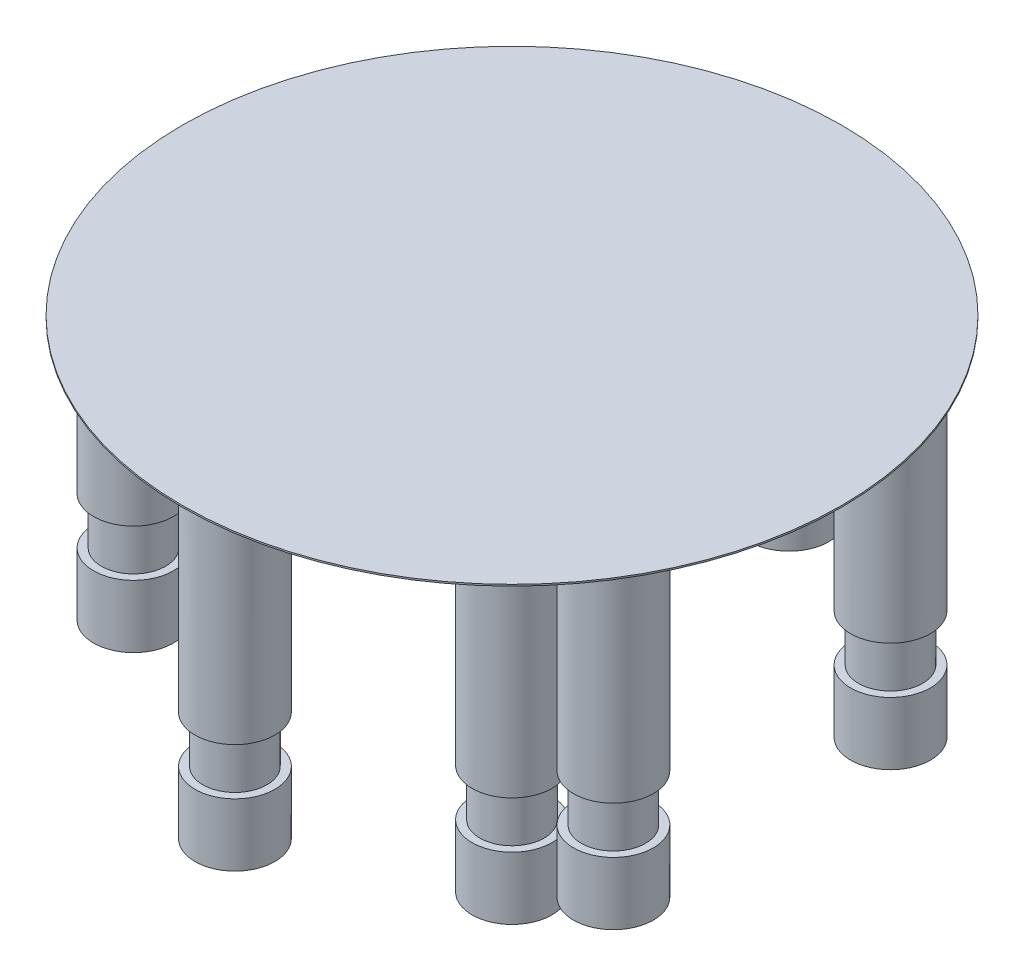
ISO-10303-21;
HEADER;
FILE_DESCRIPTION(('STEP AP214'),'2;1');
FILE_NAME('part.step','',(''),(''),'','','');
FILE_SCHEMA(('AUTOMOTIVE_DESIGN { 1 0 10303 214 1 1 1 1 }'));
ENDSEC;
DATA;
#1=APPLICATION_CONTEXT('core data for automotive mechanical design processes');
#2=APPLICATION_PROTOCOL_DEFINITION('international standard','automotive_design',2000,#1);
#3=PRODUCT_CONTEXT('',#1,'mechanical');
#4=PRODUCT('Part','Part','',(#3));
#5=PRODUCT_RELATED_PRODUCT_CATEGORY('part','',(#4));
#6=PRODUCT_DEFINITION_FORMATION('','',#4);
#7=PRODUCT_DEFINITION_CONTEXT('part definition',#1,'design');
#8=PRODUCT_DEFINITION('design','',#6,#7);
#9=PRODUCT_DEFINITION_SHAPE('','',#8);
#10=(LENGTH_UNIT() NAMED_UNIT(*) SI_UNIT(.MILLI.,.METRE.));
#11=(NAMED_UNIT(*) PLANE_ANGLE_UNIT() SI_UNIT($,.RADIAN.));
#12=(NAMED_UNIT(*) SI_UNIT($,.STERADIAN.) SOLID_ANGLE_UNIT());
#13=UNCERTAINTY_MEASURE_WITH_UNIT(LENGTH_MEASURE(1.E-05),#10,'distance_accuracy_value','');
#14=(GEOMETRIC_REPRESENTATION_CONTEXT(3) GLOBAL_UNCERTAINTY_ASSIGNED_CONTEXT((#13)) GLOBAL_UNIT_ASSIGNED_CONTEXT((#10,
#11,#12)) REPRESENTATION_CONTEXT('',''));
#15=CARTESIAN_POINT('',(0.,0.,0.));
#16=DIRECTION('',(0.,0.,1.));
#17=DIRECTION('',(1.,0.,0.));
#18=AXIS2_PLACEMENT_3D('',#15,#16,#17);
#19=CARTESIAN_POINT('',(0.,0.0254,0.));
#20=DIRECTION('',(0.,-1.,0.));
#21=DIRECTION('',(0.,0.,-1.));
#22=AXIS2_PLACEMENT_3D('',#19,#20,#21);
#23=CYLINDRICAL_SURFACE('',#22,5.3467);
#24=CARTESIAN_POINT('',(0.,0.0254,0.));
#25=DIRECTION('',(0.,1.,0.));
#26=DIRECTION('',(1.,0.,0.));
#27=AXIS2_PLACEMENT_3D('',#24,#25,#26);
#28=CIRCLE('',#27,5.3467);
#29=CARTESIAN_POINT('',(5.3467,0.0254,0.));
#30=VERTEX_POINT('',#29);
#31=EDGE_CURVE('E42',#30,#30,#28,.T.);
#32=ORIENTED_EDGE('',*,*,#31,.F.);
#33=EDGE_LOOP('',(#32));
#34=FACE_BOUND('',#33,.T.);
#35=CARTESIAN_POINT('',(0.,0.,0.));
#36=DIRECTION('',(0.,1.,0.));
#37=DIRECTION('',(1.,0.,0.));
#38=AXIS2_PLACEMENT_3D('',#35,#36,#37);
#39=CIRCLE('',#38,5.3467);
#40=CARTESIAN_POINT('',(5.3467,0.,0.));
#41=VERTEX_POINT('',#40);
#42=EDGE_CURVE('E43',#41,#41,#39,.T.);
#43=ORIENTED_EDGE('',*,*,#42,.T.);
#44=EDGE_LOOP('',(#43));
#45=FACE_BOUND('',#44,.T.);
#46=ADVANCED_FACE('F14',(#34,#45),#23,.T.);
#47=CARTESIAN_POINT('',(0.,0.0254,0.));
#48=DIRECTION('',(0.,1.,0.));
#49=DIRECTION('',(0.,0.,1.));
#50=AXIS2_PLACEMENT_3D('',#47,#48,#49);
#51=PLANE('',#50);
#52=ORIENTED_EDGE('',*,*,#31,.T.);
#53=EDGE_LOOP('',(#52));
#54=FACE_BOUND('',#53,.T.);
#55=ADVANCED_FACE('F192',(#54),#51,.T.);
#56=CARTESIAN_POINT('',(0.,0.,0.));
#57=DIRECTION('',(0.,1.,0.));
#58=DIRECTION('',(0.,0.,1.));
#59=AXIS2_PLACEMENT_3D('',#56,#57,#58);
#60=PLANE('',#59);
#61=CARTESIAN_POINT('',(0.,0.,0.));
#62=DIRECTION('',(0.,1.,0.));
#63=DIRECTION('',(0.,0.,1.));
#64=AXIS2_PLACEMENT_3D('',#61,#62,#63);
#65=CIRCLE('',#64,0.6477);
#66=CARTESIAN_POINT('',(0.,0.,0.6477));
#67=VERTEX_POINT('',#66);
#68=EDGE_CURVE('E10',#67,#67,#65,.F.);
#69=ORIENTED_EDGE('',*,*,#68,.F.);
#70=EDGE_LOOP('',(#69));
#71=FACE_BOUND('',#70,.T.);
#72=CARTESIAN_POINT('',(-3.89347701033408,0.,2.2479));
#73=DIRECTION('',(0.,1.,0.));
#74=DIRECTION('',(0.,0.,1.));
#75=AXIS2_PLACEMENT_3D('',#72,#73,#74);
#76=CIRCLE('',#75,0.6477);
#77=CARTESIAN_POINT('',(-3.89347701033408,0.,2.8956));
#78=VERTEX_POINT('',#77);
#79=EDGE_CURVE('E20',#78,#78,#76,.F.);
#80=ORIENTED_EDGE('',*,*,#79,.F.);
#81=EDGE_LOOP('',(#80));
#82=FACE_BOUND('',#81,.T.);
#83=CARTESIAN_POINT('',(-3.89347701033408,0.,-2.2479));
#84=DIRECTION('',(0.,1.,0.));
#85=DIRECTION('',(0.,0.,1.));
#86=AXIS2_PLACEMENT_3D('',#83,#84,#85);
#87=CIRCLE('',#86,0.6477);
#88=CARTESIAN_POINT('',(-3.89347701033408,0.,-1.6002));
#89=VERTEX_POINT('',#88);
#90=EDGE_CURVE('E24',#89,#89,#87,.F.);
#91=ORIENTED_EDGE('',*,*,#90,.F.);
#92=EDGE_LOOP('',(#91));
#93=FACE_BOUND('',#92,.T.);
#94=CARTESIAN_POINT('',(0.,0.,-4.4958));
#95=DIRECTION('',(0.,1.,0.));
#96=DIRECTION('',(0.,0.,1.));
#97=AXIS2_PLACEMENT_3D('',#94,#95,#96);
#98=CIRCLE('',#97,0.6477);
#99=CARTESIAN_POINT('',(0.,0.,-3.8481));
#100=VERTEX_POINT('',#99);
#101=EDGE_CURVE('E28',#100,#100,#98,.F.);
#102=ORIENTED_EDGE('',*,*,#101,.F.);
#103=EDGE_LOOP('',(#102));
#104=FACE_BOUND('',#103,.T.);
#105=CARTESIAN_POINT('',(3.89347701033408,0.,-2.2479));
#106=DIRECTION('',(0.,1.,0.));
#107=DIRECTION('',(0.,0.,1.));
#108=AXIS2_PLACEMENT_3D('',#105,#106,#107);
#109=CIRCLE('',#108,0.6477);
#110=CARTESIAN_POINT('',(3.89347701033408,0.,-1.6002));
#111=VERTEX_POINT('',#110);
#112=EDGE_CURVE('E33',#111,#111,#109,.F.);
#113=ORIENTED_EDGE('',*,*,#112,.F.);
#114=EDGE_LOOP('',(#113));
#115=FACE_BOUND('',#114,.T.);
#116=CARTESIAN_POINT('',(3.89347701033408,0.,2.2479));
#117=DIRECTION('',(0.,1.,0.));
#118=DIRECTION('',(0.,0.,1.));
#119=AXIS2_PLACEMENT_3D('',#116,#117,#118);
#120=CIRCLE('',#119,0.6477);
#121=CARTESIAN_POINT('',(3.89347701033408,0.,2.8956));
#122=VERTEX_POINT('',#121);
#123=EDGE_CURVE('E36',#122,#122,#120,.F.);
#124=ORIENTED_EDGE('',*,*,#123,.F.);
#125=EDGE_LOOP('',(#124));
#126=FACE_BOUND('',#125,.T.);
#127=CARTESIAN_POINT('',(0.,0.,4.4958));
#128=DIRECTION('',(0.,1.,0.));
#129=DIRECTION('',(0.,0.,1.));
#130=AXIS2_PLACEMENT_3D('',#127,#128,#129);
#131=CIRCLE('',#130,0.6477);
#132=CARTESIAN_POINT('',(0.,0.,5.1435));
#133=VERTEX_POINT('',#132);
#134=EDGE_CURVE('E39',#133,#133,#131,.F.);
#135=ORIENTED_EDGE('',*,*,#134,.F.);
#136=EDGE_LOOP('',(#135));
#137=FACE_BOUND('',#136,.T.);
#138=ORIENTED_EDGE('',*,*,#42,.F.);
#139=EDGE_LOOP('',(#138));
#140=FACE_BOUND('',#139,.T.);
#141=ADVANCED_FACE('F197',(#71,#82,#93,#104,#115,#126,#137,#140),#60,.F.);
#142=CARTESIAN_POINT('',(0.,-5.08,4.4958));
#143=DIRECTION('',(0.,-1.,0.));
#144=DIRECTION('',(0.,0.,-1.));
#145=AXIS2_PLACEMENT_3D('',#142,#143,#144);
#146=CYLINDRICAL_SURFACE('',#145,0.6477);
#147=CARTESIAN_POINT('',(0.,-3.302,4.4958));
#148=DIRECTION('',(0.,-1.,0.));
#149=DIRECTION('',(0.,0.,-1.));
#150=AXIS2_PLACEMENT_3D('',#147,#148,#149);
#151=CIRCLE('',#150,0.6477);
#152=CARTESIAN_POINT('',(0.,-3.302,3.8481));
#153=VERTEX_POINT('',#152);
#154=EDGE_CURVE('E46',#153,#153,#151,.T.);
#155=ORIENTED_EDGE('',*,*,#154,.F.);
#156=EDGE_LOOP('',(#155));
#157=FACE_BOUND('',#156,.T.);
#158=ORIENTED_EDGE('',*,*,#134,.T.);
#159=EDGE_LOOP('',(#158));
#160=FACE_BOUND('',#159,.T.);
#161=ADVANCED_FACE('F205',(#157,#160),#146,.T.);
#162=CARTESIAN_POINT('',(0.6477,-3.302,4.4958));
#163=DIRECTION('',(0.,1.,0.));
#164=DIRECTION('',(0.,0.,1.));
#165=AXIS2_PLACEMENT_3D('',#162,#163,#164);
#166=PLANE('',#165);
#167=CARTESIAN_POINT('',(0.,-3.302,4.4958));
#168=DIRECTION('',(0.,-1.,0.));
#169=DIRECTION('',(0.,0.,-1.));
#170=AXIS2_PLACEMENT_3D('',#167,#168,#169);
#171=CIRCLE('',#170,0.5207);
#172=CARTESIAN_POINT('',(0.,-3.302,3.9751));
#173=VERTEX_POINT('',#172);
#174=EDGE_CURVE('E51',#173,#173,#171,.T.);
#175=ORIENTED_EDGE('',*,*,#174,.F.);
#176=EDGE_LOOP('',(#175));
#177=FACE_BOUND('',#176,.T.);
#178=ORIENTED_EDGE('',*,*,#154,.T.);
#179=EDGE_LOOP('',(#178));
#180=FACE_BOUND('',#179,.T.);
#181=ADVANCED_FACE('F210',(#177,#180),#166,.F.);
#182=CARTESIAN_POINT('',(0.,-5.08,4.4958));
#183=DIRECTION('',(0.,-1.,0.));
#184=DIRECTION('',(0.,0.,-1.));
#185=AXIS2_PLACEMENT_3D('',#182,#183,#184);
#186=CYLINDRICAL_SURFACE('',#185,0.5207);
#187=CARTESIAN_POINT('',(0.,-4.064,4.4958));
#188=DIRECTION('',(0.,-1.,0.));
#189=DIRECTION('',(0.,0.,-1.));
#190=AXIS2_PLACEMENT_3D('',#187,#188,#189);
#191=CIRCLE('',#190,0.5207);
#192=CARTESIAN_POINT('',(0.,-4.064,3.9751));
#193=VERTEX_POINT('',#192);
#194=EDGE_CURVE('E54',#193,#193,#191,.T.);
#195=ORIENTED_EDGE('',*,*,#194,.F.);
#196=EDGE_LOOP('',(#195));
#197=FACE_BOUND('',#196,.T.);
#198=ORIENTED_EDGE('',*,*,#174,.T.);
#199=EDGE_LOOP('',(#198));
#200=FACE_BOUND('',#199,.T.);
#201=ADVANCED_FACE('F217',(#197,#200),#186,.T.);
#202=CARTESIAN_POINT('',(0.5207,-4.064,4.4958));
#203=DIRECTION('',(0.,-1.,0.));
#204=DIRECTION('',(0.,0.,-1.));
#205=AXIS2_PLACEMENT_3D('',#202,#203,#204);
#206=PLANE('',#205);
#207=CARTESIAN_POINT('',(0.,-4.064,4.4958));
#208=DIRECTION('',(0.,-1.,0.));
#209=DIRECTION('',(0.,0.,-1.));
#210=AXIS2_PLACEMENT_3D('',#207,#208,#209);
#211=CIRCLE('',#210,0.6477);
#212=CARTESIAN_POINT('',(0.,-4.064,3.8481));
#213=VERTEX_POINT('',#212);
#214=EDGE_CURVE('E57',#213,#213,#211,.T.);
#215=ORIENTED_EDGE('',*,*,#214,.F.);
#216=EDGE_LOOP('',(#215));
#217=FACE_BOUND('',#216,.T.);
#218=ORIENTED_EDGE('',*,*,#194,.T.);
#219=EDGE_LOOP('',(#218));
#220=FACE_BOUND('',#219,.T.);
#221=ADVANCED_FACE('F221',(#217,#220),#206,.F.);
#222=CARTESIAN_POINT('',(0.,-5.08,4.4958));
#223=DIRECTION('',(0.,-1.,0.));
#224=DIRECTION('',(0.,0.,-1.));
#225=AXIS2_PLACEMENT_3D('',#222,#223,#224);
#226=CYLINDRICAL_SURFACE('',#225,0.6477);
#227=CARTESIAN_POINT('',(0.,-5.08,4.4958));
#228=DIRECTION('',(0.,-1.,0.));
#229=DIRECTION('',(0.,0.,-1.));
#230=AXIS2_PLACEMENT_3D('',#227,#228,#229);
#231=CIRCLE('',#230,0.6477);
#232=CARTESIAN_POINT('',(0.,-5.08,3.8481));
#233=VERTEX_POINT('',#232);
#234=EDGE_CURVE('E60',#233,#233,#231,.T.);
#235=ORIENTED_EDGE('',*,*,#234,.F.);
#236=EDGE_LOOP('',(#235));
#237=FACE_BOUND('',#236,.T.);
#238=ORIENTED_EDGE('',*,*,#214,.T.);
#239=EDGE_LOOP('',(#238));
#240=FACE_BOUND('',#239,.T.);
#241=ADVANCED_FACE('F225',(#237,#240),#226,.T.);
#242=CARTESIAN_POINT('',(0.6477,-5.08,4.4958));
#243=DIRECTION('',(0.,1.,0.));
#244=DIRECTION('',(0.,0.,1.));
#245=AXIS2_PLACEMENT_3D('',#242,#243,#244);
#246=PLANE('',#245);
#247=ORIENTED_EDGE('',*,*,#234,.T.);
#248=EDGE_LOOP('',(#247));
#249=FACE_BOUND('',#248,.T.);
#250=ADVANCED_FACE('F229',(#249),#246,.F.);
#251=CARTESIAN_POINT('',(3.89347701033408,-5.08,2.2479));
#252=DIRECTION('',(0.,-1.,0.));
#253=DIRECTION('',(0.,0.,-1.));
#254=AXIS2_PLACEMENT_3D('',#251,#252,#253);
#255=CYLINDRICAL_SURFACE('',#254,0.6477);
#256=CARTESIAN_POINT('',(3.89347701033408,-3.302,2.2479));
#257=DIRECTION('',(0.,-1.,0.));
#258=DIRECTION('',(0.,0.,-1.));
#259=AXIS2_PLACEMENT_3D('',#256,#257,#258);
#260=CIRCLE('',#259,0.6477);
#261=CARTESIAN_POINT('',(3.89347701033408,-3.302,1.6002));
#262=VERTEX_POINT('',#261);
#263=EDGE_CURVE('E63',#262,#262,#260,.T.);
#264=ORIENTED_EDGE('',*,*,#263,.F.);
#265=EDGE_LOOP('',(#264));
#266=FACE_BOUND('',#265,.T.);
#267=ORIENTED_EDGE('',*,*,#123,.T.);
#268=EDGE_LOOP('',(#267));
#269=FACE_BOUND('',#268,.T.);
#270=ADVANCED_FACE('F233',(#266,#269),#255,.T.);
#271=CARTESIAN_POINT('',(4.21732701033408,-3.302,1.68697534596882));
#272=DIRECTION('',(0.,1.,0.));
#273=DIRECTION('',(0.,0.,1.));
#274=AXIS2_PLACEMENT_3D('',#271,#272,#273);
#275=PLANE('',#274);
#276=CARTESIAN_POINT('',(3.89347701033408,-3.302,2.2479));
#277=DIRECTION('',(0.,-1.,0.));
#278=DIRECTION('',(0.,0.,-1.));
#279=AXIS2_PLACEMENT_3D('',#276,#277,#278);
#280=CIRCLE('',#279,0.5207);
#281=CARTESIAN_POINT('',(3.89347701033408,-3.302,1.7272));
#282=VERTEX_POINT('',#281);
#283=EDGE_CURVE('E66',#282,#282,#280,.T.);
#284=ORIENTED_EDGE('',*,*,#283,.F.);
#285=EDGE_LOOP('',(#284));
#286=FACE_BOUND('',#285,.T.);
#287=ORIENTED_EDGE('',*,*,#263,.T.);
#288=EDGE_LOOP('',(#287));
#289=FACE_BOUND('',#288,.T.);
#290=ADVANCED_FACE('F237',(#286,#289),#275,.F.);
#291=CARTESIAN_POINT('',(3.89347701033408,-5.08,2.2479));
#292=DIRECTION('',(0.,-1.,0.));
#293=DIRECTION('',(0.,0.,-1.));
#294=AXIS2_PLACEMENT_3D('',#291,#292,#293);
#295=CYLINDRICAL_SURFACE('',#294,0.5207);
#296=CARTESIAN_POINT('',(3.89347701033408,-4.064,2.2479));
#297=DIRECTION('',(0.,-1.,0.));
#298=DIRECTION('',(0.,0.,-1.));
#299=AXIS2_PLACEMENT_3D('',#296,#297,#298);
#300=CIRCLE('',#299,0.5207);
#301=CARTESIAN_POINT('',(3.89347701033408,-4.064,1.7272));
#302=VERTEX_POINT('',#301);
#303=EDGE_CURVE('E69',#302,#302,#300,.T.);
#304=ORIENTED_EDGE('',*,*,#303,.F.);
#305=EDGE_LOOP('',(#304));
#306=FACE_BOUND('',#305,.T.);
#307=ORIENTED_EDGE('',*,*,#283,.T.);
#308=EDGE_LOOP('',(#307));
#309=FACE_BOUND('',#308,.T.);
#310=ADVANCED_FACE('F241',(#306,#309),#295,.T.);
#311=CARTESIAN_POINT('',(4.15382701033408,-4.064,1.79696057224944));
#312=DIRECTION('',(0.,-1.,0.));
#313=DIRECTION('',(0.,0.,-1.));
#314=AXIS2_PLACEMENT_3D('',#311,#312,#313);
#315=PLANE('',#314);
#316=CARTESIAN_POINT('',(3.89347701033408,-4.064,2.2479));
#317=DIRECTION('',(0.,-1.,0.));
#318=DIRECTION('',(0.,0.,-1.));
#319=AXIS2_PLACEMENT_3D('',#316,#317,#318);
#320=CIRCLE('',#319,0.6477);
#321=CARTESIAN_POINT('',(3.89347701033408,-4.064,1.6002));
#322=VERTEX_POINT('',#321);
#323=EDGE_CURVE('E72',#322,#322,#320,.T.);
#324=ORIENTED_EDGE('',*,*,#323,.F.);
#325=EDGE_LOOP('',(#324));
#326=FACE_BOUND('',#325,.T.);
#327=ORIENTED_EDGE('',*,*,#303,.T.);
#328=EDGE_LOOP('',(#327));
#329=FACE_BOUND('',#328,.T.);
#330=ADVANCED_FACE('F245',(#326,#329),#315,.F.);
#331=CARTESIAN_POINT('',(3.89347701033408,-5.08,2.2479));
#332=DIRECTION('',(0.,-1.,0.));
#333=DIRECTION('',(0.,0.,-1.));
#334=AXIS2_PLACEMENT_3D('',#331,#332,#333);
#335=CYLINDRICAL_SURFACE('',#334,0.6477);
#336=CARTESIAN_POINT('',(3.89347701033408,-5.08,2.2479));
#337=DIRECTION('',(0.,-1.,0.));
#338=DIRECTION('',(0.,0.,-1.));
#339=AXIS2_PLACEMENT_3D('',#336,#337,#338);
#340=CIRCLE('',#339,0.6477);
#341=CARTESIAN_POINT('',(3.89347701033408,-5.08,1.6002));
#342=VERTEX_POINT('',#341);
#343=EDGE_CURVE('E75',#342,#342,#340,.T.);
#344=ORIENTED_EDGE('',*,*,#343,.F.);
#345=EDGE_LOOP('',(#344));
#346=FACE_BOUND('',#345,.T.);
#347=ORIENTED_EDGE('',*,*,#323,.T.);
#348=EDGE_LOOP('',(#347));
#349=FACE_BOUND('',#348,.T.);
#350=ADVANCED_FACE('F249',(#346,#349),#335,.T.);
#351=CARTESIAN_POINT('',(4.21732701033408,-5.08,1.68697534596882));
#352=DIRECTION('',(0.,1.,0.));
#353=DIRECTION('',(0.,0.,1.));
#354=AXIS2_PLACEMENT_3D('',#351,#352,#353);
#355=PLANE('',#354);
#356=ORIENTED_EDGE('',*,*,#343,.T.);
#357=EDGE_LOOP('',(#356));
#358=FACE_BOUND('',#357,.T.);
#359=ADVANCED_FACE('F253',(#358),#355,.F.);
#360=CARTESIAN_POINT('',(3.89347701033408,-5.08,-2.2479));
#361=DIRECTION('',(0.,-1.,0.));
#362=DIRECTION('',(0.,0.,-1.));
#363=AXIS2_PLACEMENT_3D('',#360,#361,#362);
#364=CYLINDRICAL_SURFACE('',#363,0.6477);
#365=CARTESIAN_POINT('',(3.89347701033408,-3.302,-2.2479));
#366=DIRECTION('',(0.,-1.,0.));
#367=DIRECTION('',(0.,0.,-1.));
#368=AXIS2_PLACEMENT_3D('',#365,#366,#367);
#369=CIRCLE('',#368,0.6477);
#370=CARTESIAN_POINT('',(3.89347701033408,-3.302,-2.8956));
#371=VERTEX_POINT('',#370);
#372=EDGE_CURVE('E78',#371,#371,#369,.T.);
#373=ORIENTED_EDGE('',*,*,#372,.F.);
#374=EDGE_LOOP('',(#373));
#375=FACE_BOUND('',#374,.T.);
#376=ORIENTED_EDGE('',*,*,#112,.T.);
#377=EDGE_LOOP('',(#376));
#378=FACE_BOUND('',#377,.T.);
#379=ADVANCED_FACE('F257',(#375,#378),#364,.T.);
#380=CARTESIAN_POINT('',(3.56962701033408,-3.302,-2.80882465403118));
#381=DIRECTION('',(0.,1.,0.));
#382=DIRECTION('',(0.,0.,1.));
#383=AXIS2_PLACEMENT_3D('',#380,#381,#382);
#384=PLANE('',#383);
#385=CARTESIAN_POINT('',(3.89347701033408,-3.302,-2.2479));
#386=DIRECTION('',(0.,-1.,0.));
#387=DIRECTION('',(0.,0.,-1.));
#388=AXIS2_PLACEMENT_3D('',#385,#386,#387);
#389=CIRCLE('',#388,0.5207);
#390=CARTESIAN_POINT('',(3.89347701033408,-3.302,-2.7686));
#391=VERTEX_POINT('',#390);
#392=EDGE_CURVE('E81',#391,#391,#389,.T.);
#393=ORIENTED_EDGE('',*,*,#392,.F.);
#394=EDGE_LOOP('',(#393));
#395=FACE_BOUND('',#394,.T.);
#396=ORIENTED_EDGE('',*,*,#372,.T.);
#397=EDGE_LOOP('',(#396));
#398=FACE_BOUND('',#397,.T.);
#399=ADVANCED_FACE('F261',(#395,#398),#384,.F.);
#400=CARTESIAN_POINT('',(3.89347701033408,-5.08,-2.2479));
#401=DIRECTION('',(0.,-1.,0.));
#402=DIRECTION('',(0.,0.,-1.));
#403=AXIS2_PLACEMENT_3D('',#400,#401,#402);
#404=CYLINDRICAL_SURFACE('',#403,0.5207);
#405=CARTESIAN_POINT('',(3.89347701033408,-4.064,-2.2479));
#406=DIRECTION('',(0.,-1.,0.));
#407=DIRECTION('',(0.,0.,-1.));
#408=AXIS2_PLACEMENT_3D('',#405,#406,#407);
#409=CIRCLE('',#408,0.5207);
#410=CARTESIAN_POINT('',(3.89347701033408,-4.064,-2.7686));
#411=VERTEX_POINT('',#410);
#412=EDGE_CURVE('E84',#411,#411,#409,.T.);
#413=ORIENTED_EDGE('',*,*,#412,.F.);
#414=EDGE_LOOP('',(#413));
#415=FACE_BOUND('',#414,.T.);
#416=ORIENTED_EDGE('',*,*,#392,.T.);
#417=EDGE_LOOP('',(#416));
#418=FACE_BOUND('',#417,.T.);
#419=ADVANCED_FACE('F265',(#415,#418),#404,.T.);
#420=CARTESIAN_POINT('',(3.63312701033408,-4.064,-2.69883942775056));
#421=DIRECTION('',(0.,-1.,0.));
#422=DIRECTION('',(0.,0.,-1.));
#423=AXIS2_PLACEMENT_3D('',#420,#421,#422);
#424=PLANE('',#423);
#425=CARTESIAN_POINT('',(3.89347701033408,-4.064,-2.2479));
#426=DIRECTION('',(0.,-1.,0.));
#427=DIRECTION('',(0.,0.,-1.));
#428=AXIS2_PLACEMENT_3D('',#425,#426,#427);
#429=CIRCLE('',#428,0.6477);
#430=CARTESIAN_POINT('',(3.89347701033408,-4.064,-2.8956));
#431=VERTEX_POINT('',#430);
#432=EDGE_CURVE('E87',#431,#431,#429,.T.);
#433=ORIENTED_EDGE('',*,*,#432,.F.);
#434=EDGE_LOOP('',(#433));
#435=FACE_BOUND('',#434,.T.);
#436=ORIENTED_EDGE('',*,*,#412,.T.);
#437=EDGE_LOOP('',(#436));
#438=FACE_BOUND('',#437,.T.);
#439=ADVANCED_FACE('F269',(#435,#438),#424,.F.);
#440=CARTESIAN_POINT('',(3.89347701033408,-5.08,-2.2479));
#441=DIRECTION('',(0.,-1.,0.));
#442=DIRECTION('',(0.,0.,-1.));
#443=AXIS2_PLACEMENT_3D('',#440,#441,#442);
#444=CYLINDRICAL_SURFACE('',#443,0.6477);
#445=CARTESIAN_POINT('',(3.89347701033408,-5.08,-2.2479));
#446=DIRECTION('',(0.,-1.,0.));
#447=DIRECTION('',(0.,0.,-1.));
#448=AXIS2_PLACEMENT_3D('',#445,#446,#447);
#449=CIRCLE('',#448,0.6477);
#450=CARTESIAN_POINT('',(3.89347701033408,-5.08,-2.8956));
#451=VERTEX_POINT('',#450);
#452=EDGE_CURVE('E90',#451,#451,#449,.T.);
#453=ORIENTED_EDGE('',*,*,#452,.F.);
#454=EDGE_LOOP('',(#453));
#455=FACE_BOUND('',#454,.T.);
#456=ORIENTED_EDGE('',*,*,#432,.T.);
#457=EDGE_LOOP('',(#456));
#458=FACE_BOUND('',#457,.T.);
#459=ADVANCED_FACE('F273',(#455,#458),#444,.T.);
#460=CARTESIAN_POINT('',(3.56962701033408,-5.08,-2.80882465403118));
#461=DIRECTION('',(0.,1.,0.));
#462=DIRECTION('',(0.,0.,1.));
#463=AXIS2_PLACEMENT_3D('',#460,#461,#462);
#464=PLANE('',#463);
#465=ORIENTED_EDGE('',*,*,#452,.T.);
#466=EDGE_LOOP('',(#465));
#467=FACE_BOUND('',#466,.T.);
#468=ADVANCED_FACE('F277',(#467),#464,.F.);
#469=CARTESIAN_POINT('',(0.,-5.08,-4.4958));
#470=DIRECTION('',(0.,-1.,0.));
#471=DIRECTION('',(0.,0.,-1.));
#472=AXIS2_PLACEMENT_3D('',#469,#470,#471);
#473=CYLINDRICAL_SURFACE('',#472,0.6477);
#474=CARTESIAN_POINT('',(0.,-3.302,-4.4958));
#475=DIRECTION('',(0.,-1.,0.));
#476=DIRECTION('',(0.,0.,-1.));
#477=AXIS2_PLACEMENT_3D('',#474,#475,#476);
#478=CIRCLE('',#477,0.6477);
#479=CARTESIAN_POINT('',(0.,-3.302,-5.1435));
#480=VERTEX_POINT('',#479);
#481=EDGE_CURVE('E93',#480,#480,#478,.T.);
#482=ORIENTED_EDGE('',*,*,#481,.F.);
#483=EDGE_LOOP('',(#482));
#484=FACE_BOUND('',#483,.T.);
#485=ORIENTED_EDGE('',*,*,#101,.T.);
#486=EDGE_LOOP('',(#485));
#487=FACE_BOUND('',#486,.T.);
#488=ADVANCED_FACE('F281',(#484,#487),#473,.T.);
#489=CARTESIAN_POINT('',(-0.647699999999998,-3.302,-4.4958));
#490=DIRECTION('',(0.,1.,0.));
#491=DIRECTION('',(0.,0.,1.));
#492=AXIS2_PLACEMENT_3D('',#489,#490,#491);
#493=PLANE('',#492);
#494=CARTESIAN_POINT('',(0.,-3.302,-4.4958));
#495=DIRECTION('',(0.,-1.,0.));
#496=DIRECTION('',(0.,0.,-1.));
#497=AXIS2_PLACEMENT_3D('',#494,#495,#496);
#498=CIRCLE('',#497,0.5207);
#499=CARTESIAN_POINT('',(0.,-3.302,-5.0165));
#500=VERTEX_POINT('',#499);
#501=EDGE_CURVE('E96',#500,#500,#498,.T.);
#502=ORIENTED_EDGE('',*,*,#501,.F.);
#503=EDGE_LOOP('',(#502));
#504=FACE_BOUND('',#503,.T.);
#505=ORIENTED_EDGE('',*,*,#481,.T.);
#506=EDGE_LOOP('',(#505));
#507=FACE_BOUND('',#506,.T.);
#508=ADVANCED_FACE('F285',(#504,#507),#493,.F.);
#509=CARTESIAN_POINT('',(0.,-5.08,-4.4958));
#510=DIRECTION('',(0.,-1.,0.));
#511=DIRECTION('',(0.,0.,-1.));
#512=AXIS2_PLACEMENT_3D('',#509,#510,#511);
#513=CYLINDRICAL_SURFACE('',#512,0.5207);
#514=CARTESIAN_POINT('',(0.,-4.064,-4.4958));
#515=DIRECTION('',(0.,-1.,0.));
#516=DIRECTION('',(0.,0.,-1.));
#517=AXIS2_PLACEMENT_3D('',#514,#515,#516);
#518=CIRCLE('',#517,0.5207);
#519=CARTESIAN_POINT('',(0.,-4.064,-5.0165));
#520=VERTEX_POINT('',#519);
#521=EDGE_CURVE('E99',#520,#520,#518,.T.);
#522=ORIENTED_EDGE('',*,*,#521,.F.);
#523=EDGE_LOOP('',(#522));
#524=FACE_BOUND('',#523,.T.);
#525=ORIENTED_EDGE('',*,*,#501,.T.);
#526=EDGE_LOOP('',(#525));
#527=FACE_BOUND('',#526,.T.);
#528=ADVANCED_FACE('F289',(#524,#527),#513,.T.);
#529=CARTESIAN_POINT('',(-0.520699999999998,-4.064,-4.4958));
#530=DIRECTION('',(0.,-1.,0.));
#531=DIRECTION('',(0.,0.,-1.));
#532=AXIS2_PLACEMENT_3D('',#529,#530,#531);
#533=PLANE('',#532);
#534=CARTESIAN_POINT('',(0.,-4.064,-4.4958));
#535=DIRECTION('',(0.,-1.,0.));
#536=DIRECTION('',(0.,0.,-1.));
#537=AXIS2_PLACEMENT_3D('',#534,#535,#536);
#538=CIRCLE('',#537,0.6477);
#539=CARTESIAN_POINT('',(0.,-4.064,-5.1435));
#540=VERTEX_POINT('',#539);
#541=EDGE_CURVE('E102',#540,#540,#538,.T.);
#542=ORIENTED_EDGE('',*,*,#541,.F.);
#543=EDGE_LOOP('',(#542));
#544=FACE_BOUND('',#543,.T.);
#545=ORIENTED_EDGE('',*,*,#521,.T.);
#546=EDGE_LOOP('',(#545));
#547=FACE_BOUND('',#546,.T.);
#548=ADVANCED_FACE('F293',(#544,#547),#533,.F.);
#549=CARTESIAN_POINT('',(0.,-5.08,-4.4958));
#550=DIRECTION('',(0.,-1.,0.));
#551=DIRECTION('',(0.,0.,-1.));
#552=AXIS2_PLACEMENT_3D('',#549,#550,#551);
#553=CYLINDRICAL_SURFACE('',#552,0.6477);
#554=CARTESIAN_POINT('',(0.,-5.08,-4.4958));
#555=DIRECTION('',(0.,-1.,0.));
#556=DIRECTION('',(0.,0.,-1.));
#557=AXIS2_PLACEMENT_3D('',#554,#555,#556);
#558=CIRCLE('',#557,0.6477);
#559=CARTESIAN_POINT('',(0.,-5.08,-5.1435));
#560=VERTEX_POINT('',#559);
#561=EDGE_CURVE('E105',#560,#560,#558,.T.);
#562=ORIENTED_EDGE('',*,*,#561,.F.);
#563=EDGE_LOOP('',(#562));
#564=FACE_BOUND('',#563,.T.);
#565=ORIENTED_EDGE('',*,*,#541,.T.);
#566=EDGE_LOOP('',(#565));
#567=FACE_BOUND('',#566,.T.);
#568=ADVANCED_FACE('F297',(#564,#567),#553,.T.);
#569=CARTESIAN_POINT('',(-0.647699999999998,-5.08,-4.4958));
#570=DIRECTION('',(0.,1.,0.));
#571=DIRECTION('',(0.,0.,1.));
#572=AXIS2_PLACEMENT_3D('',#569,#570,#571);
#573=PLANE('',#572);
#574=ORIENTED_EDGE('',*,*,#561,.T.);
#575=EDGE_LOOP('',(#574));
#576=FACE_BOUND('',#575,.T.);
#577=ADVANCED_FACE('F301',(#576),#573,.F.);
#578=CARTESIAN_POINT('',(-3.89347701033408,-5.08,-2.2479));
#579=DIRECTION('',(0.,-1.,0.));
#580=DIRECTION('',(0.,0.,-1.));
#581=AXIS2_PLACEMENT_3D('',#578,#579,#580);
#582=CYLINDRICAL_SURFACE('',#581,0.6477);
#583=CARTESIAN_POINT('',(-3.89347701033408,-3.302,-2.2479));
#584=DIRECTION('',(0.,-1.,0.));
#585=DIRECTION('',(0.,0.,-1.));
#586=AXIS2_PLACEMENT_3D('',#583,#584,#585);
#587=CIRCLE('',#586,0.6477);
#588=CARTESIAN_POINT('',(-3.89347701033408,-3.302,-2.8956));
#589=VERTEX_POINT('',#588);
#590=EDGE_CURVE('E108',#589,#589,#587,.T.);
#591=ORIENTED_EDGE('',*,*,#590,.F.);
#592=EDGE_LOOP('',(#591));
#593=FACE_BOUND('',#592,.T.);
#594=ORIENTED_EDGE('',*,*,#90,.T.);
#595=EDGE_LOOP('',(#594));
#596=FACE_BOUND('',#595,.T.);
#597=ADVANCED_FACE('F305',(#593,#596),#582,.T.);
#598=CARTESIAN_POINT('',(-4.21732701033408,-3.302,-1.68697534596882));
#599=DIRECTION('',(0.,1.,0.));
#600=DIRECTION('',(0.,0.,1.));
#601=AXIS2_PLACEMENT_3D('',#598,#599,#600);
#602=PLANE('',#601);
#603=CARTESIAN_POINT('',(-3.89347701033408,-3.302,-2.2479));
#604=DIRECTION('',(0.,-1.,0.));
#605=DIRECTION('',(0.,0.,-1.));
#606=AXIS2_PLACEMENT_3D('',#603,#604,#605);
#607=CIRCLE('',#606,0.5207);
#608=CARTESIAN_POINT('',(-3.89347701033408,-3.302,-2.7686));
#609=VERTEX_POINT('',#608);
#610=EDGE_CURVE('E111',#609,#609,#607,.T.);
#611=ORIENTED_EDGE('',*,*,#610,.F.);
#612=EDGE_LOOP('',(#611));
#613=FACE_BOUND('',#612,.T.);
#614=ORIENTED_EDGE('',*,*,#590,.T.);
#615=EDGE_LOOP('',(#614));
#616=FACE_BOUND('',#615,.T.);
#617=ADVANCED_FACE('F309',(#613,#616),#602,.F.);
#618=CARTESIAN_POINT('',(-3.89347701033408,-5.08,-2.2479));
#619=DIRECTION('',(0.,-1.,0.));
#620=DIRECTION('',(0.,0.,-1.));
#621=AXIS2_PLACEMENT_3D('',#618,#619,#620);
#622=CYLINDRICAL_SURFACE('',#621,0.5207);
#623=CARTESIAN_POINT('',(-3.89347701033408,-4.064,-2.2479));
#624=DIRECTION('',(0.,-1.,0.));
#625=DIRECTION('',(0.,0.,-1.));
#626=AXIS2_PLACEMENT_3D('',#623,#624,#625);
#627=CIRCLE('',#626,0.5207);
#628=CARTESIAN_POINT('',(-3.89347701033408,-4.064,-2.7686));
#629=VERTEX_POINT('',#628);
#630=EDGE_CURVE('E114',#629,#629,#627,.T.);
#631=ORIENTED_EDGE('',*,*,#630,.F.);
#632=EDGE_LOOP('',(#631));
#633=FACE_BOUND('',#632,.T.);
#634=ORIENTED_EDGE('',*,*,#610,.T.);
#635=EDGE_LOOP('',(#634));
#636=FACE_BOUND('',#635,.T.);
#637=ADVANCED_FACE('F313',(#633,#636),#622,.T.);
#638=CARTESIAN_POINT('',(-4.15382701033408,-4.064,-1.79696057224944));
#639=DIRECTION('',(0.,-1.,0.));
#640=DIRECTION('',(0.,0.,-1.));
#641=AXIS2_PLACEMENT_3D('',#638,#639,#640);
#642=PLANE('',#641);
#643=CARTESIAN_POINT('',(-3.89347701033408,-4.064,-2.2479));
#644=DIRECTION('',(0.,-1.,0.));
#645=DIRECTION('',(0.,0.,-1.));
#646=AXIS2_PLACEMENT_3D('',#643,#644,#645);
#647=CIRCLE('',#646,0.6477);
#648=CARTESIAN_POINT('',(-3.89347701033408,-4.064,-2.8956));
#649=VERTEX_POINT('',#648);
#650=EDGE_CURVE('E117',#649,#649,#647,.T.);
#651=ORIENTED_EDGE('',*,*,#650,.F.);
#652=EDGE_LOOP('',(#651));
#653=FACE_BOUND('',#652,.T.);
#654=ORIENTED_EDGE('',*,*,#630,.T.);
#655=EDGE_LOOP('',(#654));
#656=FACE_BOUND('',#655,.T.);
#657=ADVANCED_FACE('F317',(#653,#656),#642,.F.);
#658=CARTESIAN_POINT('',(-3.89347701033408,-5.08,-2.2479));
#659=DIRECTION('',(0.,-1.,0.));
#660=DIRECTION('',(0.,0.,-1.));
#661=AXIS2_PLACEMENT_3D('',#658,#659,#660);
#662=CYLINDRICAL_SURFACE('',#661,0.6477);
#663=CARTESIAN_POINT('',(-3.89347701033408,-5.08,-2.2479));
#664=DIRECTION('',(0.,-1.,0.));
#665=DIRECTION('',(0.,0.,-1.));
#666=AXIS2_PLACEMENT_3D('',#663,#664,#665);
#667=CIRCLE('',#666,0.6477);
#668=CARTESIAN_POINT('',(-3.89347701033408,-5.08,-2.8956));
#669=VERTEX_POINT('',#668);
#670=EDGE_CURVE('E120',#669,#669,#667,.T.);
#671=ORIENTED_EDGE('',*,*,#670,.F.);
#672=EDGE_LOOP('',(#671));
#673=FACE_BOUND('',#672,.T.);
#674=ORIENTED_EDGE('',*,*,#650,.T.);
#675=EDGE_LOOP('',(#674));
#676=FACE_BOUND('',#675,.T.);
#677=ADVANCED_FACE('F321',(#673,#676),#662,.T.);
#678=CARTESIAN_POINT('',(-4.21732701033408,-5.08,-1.68697534596882));
#679=DIRECTION('',(0.,1.,0.));
#680=DIRECTION('',(0.,0.,1.));
#681=AXIS2_PLACEMENT_3D('',#678,#679,#680);
#682=PLANE('',#681);
#683=ORIENTED_EDGE('',*,*,#670,.T.);
#684=EDGE_LOOP('',(#683));
#685=FACE_BOUND('',#684,.T.);
#686=ADVANCED_FACE('F325',(#685),#682,.F.);
#687=CARTESIAN_POINT('',(-3.89347701033408,-5.08,2.2479));
#688=DIRECTION('',(0.,-1.,0.));
#689=DIRECTION('',(0.,0.,-1.));
#690=AXIS2_PLACEMENT_3D('',#687,#688,#689);
#691=CYLINDRICAL_SURFACE('',#690,0.6477);
#692=CARTESIAN_POINT('',(-3.89347701033408,-3.302,2.2479));
#693=DIRECTION('',(0.,-1.,0.));
#694=DIRECTION('',(0.,0.,-1.));
#695=AXIS2_PLACEMENT_3D('',#692,#693,#694);
#696=CIRCLE('',#695,0.6477);
#697=CARTESIAN_POINT('',(-3.89347701033408,-3.302,1.6002));
#698=VERTEX_POINT('',#697);
#699=EDGE_CURVE('E123',#698,#698,#696,.T.);
#700=ORIENTED_EDGE('',*,*,#699,.F.);
#701=EDGE_LOOP('',(#700));
#702=FACE_BOUND('',#701,.T.);
#703=ORIENTED_EDGE('',*,*,#79,.T.);
#704=EDGE_LOOP('',(#703));
#705=FACE_BOUND('',#704,.T.);
#706=ADVANCED_FACE('F329',(#702,#705),#691,.T.);
#707=CARTESIAN_POINT('',(-3.56962701033408,-3.302,2.80882465403118));
#708=DIRECTION('',(0.,1.,0.));
#709=DIRECTION('',(0.,0.,1.));
#710=AXIS2_PLACEMENT_3D('',#707,#708,#709);
#711=PLANE('',#710);
#712=CARTESIAN_POINT('',(-3.89347701033408,-3.302,2.2479));
#713=DIRECTION('',(0.,-1.,0.));
#714=DIRECTION('',(0.,0.,-1.));
#715=AXIS2_PLACEMENT_3D('',#712,#713,#714);
#716=CIRCLE('',#715,0.5207);
#717=CARTESIAN_POINT('',(-3.89347701033408,-3.302,1.7272));
#718=VERTEX_POINT('',#717);
#719=EDGE_CURVE('E126',#718,#718,#716,.T.);
#720=ORIENTED_EDGE('',*,*,#719,.F.);
#721=EDGE_LOOP('',(#720));
#722=FACE_BOUND('',#721,.T.);
#723=ORIENTED_EDGE('',*,*,#699,.T.);
#724=EDGE_LOOP('',(#723));
#725=FACE_BOUND('',#724,.T.);
#726=ADVANCED_FACE('F333',(#722,#725),#711,.F.);
#727=CARTESIAN_POINT('',(-3.89347701033408,-5.08,2.2479));
#728=DIRECTION('',(0.,-1.,0.));
#729=DIRECTION('',(0.,0.,-1.));
#730=AXIS2_PLACEMENT_3D('',#727,#728,#729);
#731=CYLINDRICAL_SURFACE('',#730,0.5207);
#732=CARTESIAN_POINT('',(-3.89347701033408,-4.064,2.2479));
#733=DIRECTION('',(0.,-1.,0.));
#734=DIRECTION('',(0.,0.,-1.));
#735=AXIS2_PLACEMENT_3D('',#732,#733,#734);
#736=CIRCLE('',#735,0.5207);
#737=CARTESIAN_POINT('',(-3.89347701033408,-4.064,1.7272));
#738=VERTEX_POINT('',#737);
#739=EDGE_CURVE('E129',#738,#738,#736,.T.);
#740=ORIENTED_EDGE('',*,*,#739,.F.);
#741=EDGE_LOOP('',(#740));
#742=FACE_BOUND('',#741,.T.);
#743=ORIENTED_EDGE('',*,*,#719,.T.);
#744=EDGE_LOOP('',(#743));
#745=FACE_BOUND('',#744,.T.);
#746=ADVANCED_FACE('F337',(#742,#745),#731,.T.);
#747=CARTESIAN_POINT('',(-3.63312701033408,-4.064,2.69883942775055));
#748=DIRECTION('',(0.,-1.,0.));
#749=DIRECTION('',(0.,0.,-1.));
#750=AXIS2_PLACEMENT_3D('',#747,#748,#749);
#751=PLANE('',#750);
#752=CARTESIAN_POINT('',(-3.89347701033408,-4.064,2.2479));
#753=DIRECTION('',(0.,-1.,0.));
#754=DIRECTION('',(0.,0.,-1.));
#755=AXIS2_PLACEMENT_3D('',#752,#753,#754);
#756=CIRCLE('',#755,0.6477);
#757=CARTESIAN_POINT('',(-3.89347701033408,-4.064,1.6002));
#758=VERTEX_POINT('',#757);
#759=EDGE_CURVE('E132',#758,#758,#756,.T.);
#760=ORIENTED_EDGE('',*,*,#759,.F.);
#761=EDGE_LOOP('',(#760));
#762=FACE_BOUND('',#761,.T.);
#763=ORIENTED_EDGE('',*,*,#739,.T.);
#764=EDGE_LOOP('',(#763));
#765=FACE_BOUND('',#764,.T.);
#766=ADVANCED_FACE('F341',(#762,#765),#751,.F.);
#767=CARTESIAN_POINT('',(-3.89347701033408,-5.08,2.2479));
#768=DIRECTION('',(0.,-1.,0.));
#769=DIRECTION('',(0.,0.,-1.));
#770=AXIS2_PLACEMENT_3D('',#767,#768,#769);
#771=CYLINDRICAL_SURFACE('',#770,0.6477);
#772=CARTESIAN_POINT('',(-3.89347701033408,-5.08,2.2479));
#773=DIRECTION('',(0.,-1.,0.));
#774=DIRECTION('',(0.,0.,-1.));
#775=AXIS2_PLACEMENT_3D('',#772,#773,#774);
#776=CIRCLE('',#775,0.6477);
#777=CARTESIAN_POINT('',(-3.89347701033408,-5.08,1.6002));
#778=VERTEX_POINT('',#777);
#779=EDGE_CURVE('E135',#778,#778,#776,.T.);
#780=ORIENTED_EDGE('',*,*,#779,.F.);
#781=EDGE_LOOP('',(#780));
#782=FACE_BOUND('',#781,.T.);
#783=ORIENTED_EDGE('',*,*,#759,.T.);
#784=EDGE_LOOP('',(#783));
#785=FACE_BOUND('',#784,.T.);
#786=ADVANCED_FACE('F188',(#782,#785),#771,.T.);
#787=CARTESIAN_POINT('',(-3.56962701033408,-5.08,2.80882465403118));
#788=DIRECTION('',(0.,1.,0.));
#789=DIRECTION('',(0.,0.,1.));
#790=AXIS2_PLACEMENT_3D('',#787,#788,#789);
#791=PLANE('',#790);
#792=ORIENTED_EDGE('',*,*,#779,.T.);
#793=EDGE_LOOP('',(#792));
#794=FACE_BOUND('',#793,.T.);
#795=ADVANCED_FACE('F182',(#794),#791,.F.);
#796=CARTESIAN_POINT('',(0.,-8.0772,0.));
#797=DIRECTION('',(0.,-1.,0.));
#798=DIRECTION('',(0.,0.,-1.));
#799=AXIS2_PLACEMENT_3D('',#796,#797,#798);
#800=CYLINDRICAL_SURFACE('',#799,0.6477);
#801=CARTESIAN_POINT('',(0.,-6.2992,0.));
#802=DIRECTION('',(0.,-1.,0.));
#803=DIRECTION('',(0.,0.,-1.));
#804=AXIS2_PLACEMENT_3D('',#801,#802,#803);
#805=CIRCLE('',#804,0.6477);
#806=CARTESIAN_POINT('',(0.,-6.2992,-0.6477));
#807=VERTEX_POINT('',#806);
#808=EDGE_CURVE('E138',#807,#807,#805,.T.);
#809=ORIENTED_EDGE('',*,*,#808,.F.);
#810=EDGE_LOOP('',(#809));
#811=FACE_BOUND('',#810,.T.);
#812=ORIENTED_EDGE('',*,*,#68,.T.);
#813=EDGE_LOOP('',(#812));
#814=FACE_BOUND('',#813,.T.);
#815=ADVANCED_FACE('F177',(#811,#814),#800,.T.);
#816=CARTESIAN_POINT('',(0.6477,-6.2992,0.));
#817=DIRECTION('',(0.,1.,0.));
#818=DIRECTION('',(0.,0.,1.));
#819=AXIS2_PLACEMENT_3D('',#816,#817,#818);
#820=PLANE('',#819);
#821=CARTESIAN_POINT('',(0.,-6.2992,0.));
#822=DIRECTION('',(0.,-1.,0.));
#823=DIRECTION('',(0.,0.,-1.));
#824=AXIS2_PLACEMENT_3D('',#821,#822,#823);
#825=CIRCLE('',#824,0.5207);
#826=CARTESIAN_POINT('',(0.,-6.2992,-0.5207));
#827=VERTEX_POINT('',#826);
#828=EDGE_CURVE('E141',#827,#827,#825,.T.);
#829=ORIENTED_EDGE('',*,*,#828,.F.);
#830=EDGE_LOOP('',(#829));
#831=FACE_BOUND('',#830,.T.);
#832=ORIENTED_EDGE('',*,*,#808,.T.);
#833=EDGE_LOOP('',(#832));
#834=FACE_BOUND('',#833,.T.);
#835=ADVANCED_FACE('F171',(#831,#834),#820,.F.);
#836=CARTESIAN_POINT('',(0.,-8.0772,0.));
#837=DIRECTION('',(0.,-1.,0.));
#838=DIRECTION('',(0.,0.,-1.));
#839=AXIS2_PLACEMENT_3D('',#836,#837,#838);
#840=CYLINDRICAL_SURFACE('',#839,0.5207);
#841=CARTESIAN_POINT('',(0.,-7.0612,0.));
#842=DIRECTION('',(0.,-1.,0.));
#843=DIRECTION('',(0.,0.,-1.));
#844=AXIS2_PLACEMENT_3D('',#841,#842,#843);
#845=CIRCLE('',#844,0.5207);
#846=CARTESIAN_POINT('',(0.,-7.0612,-0.5207));
#847=VERTEX_POINT('',#846);
#848=EDGE_CURVE('E144',#847,#847,#845,.T.);
#849=ORIENTED_EDGE('',*,*,#848,.F.);
#850=EDGE_LOOP('',(#849));
#851=FACE_BOUND('',#850,.T.);
#852=ORIENTED_EDGE('',*,*,#828,.T.);
#853=EDGE_LOOP('',(#852));
#854=FACE_BOUND('',#853,.T.);
#855=ADVANCED_FACE('F165',(#851,#854),#840,.T.);
#856=CARTESIAN_POINT('',(0.5207,-7.0612,0.));
#857=DIRECTION('',(0.,-1.,0.));
#858=DIRECTION('',(0.,0.,-1.));
#859=AXIS2_PLACEMENT_3D('',#856,#857,#858);
#860=PLANE('',#859);
#861=CARTESIAN_POINT('',(0.,-7.0612,0.));
#862=DIRECTION('',(0.,-1.,0.));
#863=DIRECTION('',(0.,0.,-1.));
#864=AXIS2_PLACEMENT_3D('',#861,#862,#863);
#865=CIRCLE('',#864,0.6477);
#866=CARTESIAN_POINT('',(0.,-7.0612,-0.6477));
#867=VERTEX_POINT('',#866);
#868=EDGE_CURVE('E147',#867,#867,#865,.T.);
#869=ORIENTED_EDGE('',*,*,#868,.F.);
#870=EDGE_LOOP('',(#869));
#871=FACE_BOUND('',#870,.T.);
#872=ORIENTED_EDGE('',*,*,#848,.T.);
#873=EDGE_LOOP('',(#872));
#874=FACE_BOUND('',#873,.T.);
#875=ADVANCED_FACE('F159',(#871,#874),#860,.F.);
#876=CARTESIAN_POINT('',(0.,-8.0772,0.));
#877=DIRECTION('',(0.,-1.,0.));
#878=DIRECTION('',(0.,0.,-1.));
#879=AXIS2_PLACEMENT_3D('',#876,#877,#878);
#880=CYLINDRICAL_SURFACE('',#879,0.6477);
#881=CARTESIAN_POINT('',(0.,-8.0772,0.));
#882=DIRECTION('',(0.,-1.,0.));
#883=DIRECTION('',(0.,0.,-1.));
#884=AXIS2_PLACEMENT_3D('',#881,#882,#883);
#885=CIRCLE('',#884,0.6477);
#886=CARTESIAN_POINT('',(0.,-8.0772,-0.6477));
#887=VERTEX_POINT('',#886);
#888=EDGE_CURVE('E150',#887,#887,#885,.T.);
#889=ORIENTED_EDGE('',*,*,#888,.F.);
#890=EDGE_LOOP('',(#889));
#891=FACE_BOUND('',#890,.T.);
#892=ORIENTED_EDGE('',*,*,#868,.T.);
#893=EDGE_LOOP('',(#892));
#894=FACE_BOUND('',#893,.T.);
#895=ADVANCED_FACE('F156',(#891,#894),#880,.T.);
#896=CARTESIAN_POINT('',(0.6477,-8.0772,0.));
#897=DIRECTION('',(0.,1.,0.));
#898=DIRECTION('',(0.,0.,1.));
#899=AXIS2_PLACEMENT_3D('',#896,#897,#898);
#900=PLANE('',#899);
#901=ORIENTED_EDGE('',*,*,#888,.T.);
#902=EDGE_LOOP('',(#901));
#903=FACE_BOUND('',#902,.T.);
#904=ADVANCED_FACE('F154',(#903),#900,.F.);
#905=CLOSED_SHELL('',(#46,#55,#141,#161,#181,#201,#221,#241,#250,#270,#290,#310,#330,#350,#359,
#379,#399,#419,#439,#459,#468,#488,#508,#528,#548,#568,#577,#597,#617,#637,#657,#677,#686,#706,
#726,#746,#766,#786,#795,#815,#835,#855,#875,#895,#904));
#906=MANIFOLD_SOLID_BREP('B1',#905);
#907=ADVANCED_BREP_SHAPE_REPRESENTATION('',(#18,#906),#14);
#908=SHAPE_DEFINITION_REPRESENTATION(#9,#907);
ENDSEC;
END-ISO-10303-21;
